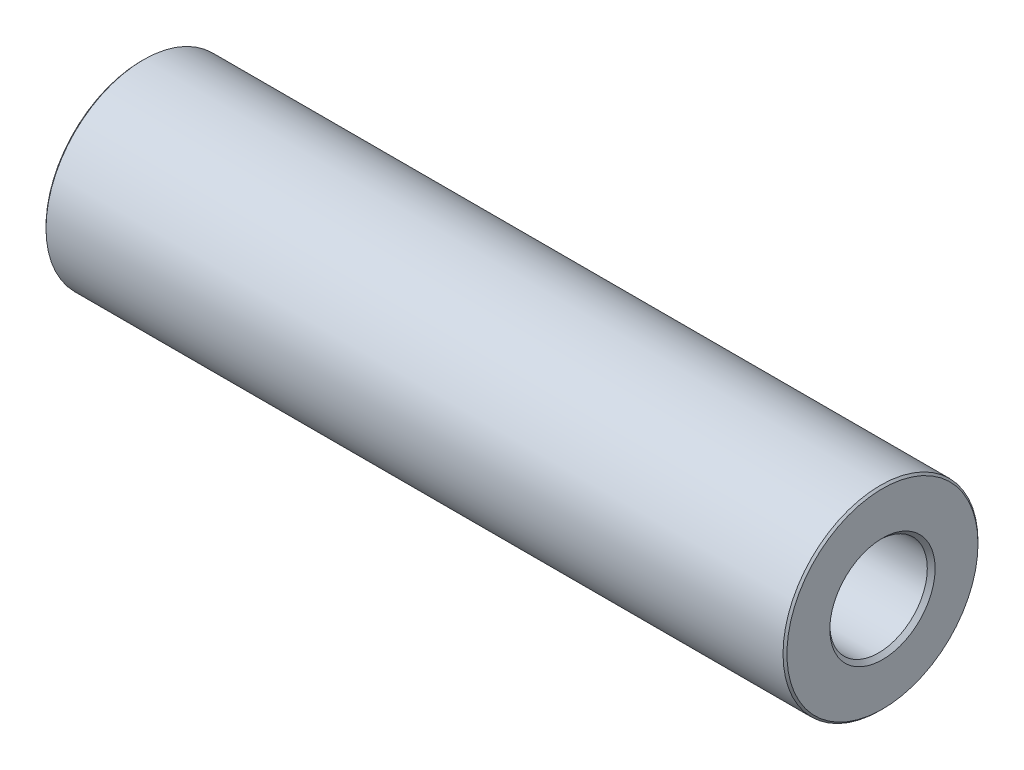
ISO-10303-21;
HEADER;
FILE_DESCRIPTION(('STEP AP214'),'2;1');
FILE_NAME('part.step','',(''),(''),'','','');
FILE_SCHEMA(('AUTOMOTIVE_DESIGN { 1 0 10303 214 1 1 1 1 }'));
ENDSEC;
DATA;
#1=APPLICATION_CONTEXT('core data for automotive mechanical design processes');
#2=APPLICATION_PROTOCOL_DEFINITION('international standard','automotive_design',2000,#1);
#3=PRODUCT_CONTEXT('',#1,'mechanical');
#4=PRODUCT('Part','Part','',(#3));
#5=PRODUCT_RELATED_PRODUCT_CATEGORY('part','',(#4));
#6=PRODUCT_DEFINITION_FORMATION('','',#4);
#7=PRODUCT_DEFINITION_CONTEXT('part definition',#1,'design');
#8=PRODUCT_DEFINITION('design','',#6,#7);
#9=PRODUCT_DEFINITION_SHAPE('','',#8);
#10=(LENGTH_UNIT() NAMED_UNIT(*) SI_UNIT(.MILLI.,.METRE.));
#11=(NAMED_UNIT(*) PLANE_ANGLE_UNIT() SI_UNIT($,.RADIAN.));
#12=(NAMED_UNIT(*) SI_UNIT($,.STERADIAN.) SOLID_ANGLE_UNIT());
#13=UNCERTAINTY_MEASURE_WITH_UNIT(LENGTH_MEASURE(1.E-05),#10,'distance_accuracy_value','');
#14=(GEOMETRIC_REPRESENTATION_CONTEXT(3) GLOBAL_UNCERTAINTY_ASSIGNED_CONTEXT((#13)) GLOBAL_UNIT_ASSIGNED_CONTEXT((#10,
#11,#12)) REPRESENTATION_CONTEXT('',''));
#15=CARTESIAN_POINT('',(0.,0.,0.));
#16=DIRECTION('',(0.,0.,1.));
#17=DIRECTION('',(1.,0.,0.));
#18=AXIS2_PLACEMENT_3D('',#15,#16,#17);
#19=CARTESIAN_POINT('',(38.,0.,0.));
#20=DIRECTION('',(1.,0.,0.));
#21=DIRECTION('',(0.,0.,-1.));
#22=AXIS2_PLACEMENT_3D('',#19,#20,#21);
#23=PLANE('',#22);
#24=CARTESIAN_POINT('',(38.,0.,0.));
#25=DIRECTION('',(1.,0.,0.));
#26=DIRECTION('',(0.,0.,-1.));
#27=AXIS2_PLACEMENT_3D('',#24,#25,#26);
#28=CIRCLE('',#27,2.69999999999999);
#29=CARTESIAN_POINT('',(38.,0.,-2.69999999999999));
#30=VERTEX_POINT('',#29);
#31=EDGE_CURVE('E8',#30,#30,#28,.F.);
#32=ORIENTED_EDGE('',*,*,#31,.T.);
#33=EDGE_LOOP('',(#32));
#34=FACE_BOUND('',#33,.T.);
#35=CARTESIAN_POINT('',(38.,0.,0.));
#36=DIRECTION('',(1.,0.,0.));
#37=DIRECTION('',(0.,0.,-1.));
#38=AXIS2_PLACEMENT_3D('',#35,#36,#37);
#39=CIRCLE('',#38,4.9);
#40=CARTESIAN_POINT('',(38.,0.,-4.9));
#41=VERTEX_POINT('',#40);
#42=EDGE_CURVE('E24',#41,#41,#39,.T.);
#43=ORIENTED_EDGE('',*,*,#42,.T.);
#44=EDGE_LOOP('',(#43));
#45=FACE_BOUND('',#44,.T.);
#46=ADVANCED_FACE('F13',(#34,#45),#23,.T.);
#47=CARTESIAN_POINT('',(0.,0.,0.));
#48=DIRECTION('',(1.,0.,0.));
#49=DIRECTION('',(0.,0.,-1.));
#50=AXIS2_PLACEMENT_3D('',#47,#48,#49);
#51=PLANE('',#50);
#52=CARTESIAN_POINT('',(0.,0.,0.));
#53=DIRECTION('',(1.,0.,0.));
#54=DIRECTION('',(0.,0.,-1.));
#55=AXIS2_PLACEMENT_3D('',#52,#53,#54);
#56=CIRCLE('',#55,2.59999999999999);
#57=CARTESIAN_POINT('',(0.,0.,-2.59999999999999));
#58=VERTEX_POINT('',#57);
#59=EDGE_CURVE('E39',#58,#58,#56,.T.);
#60=ORIENTED_EDGE('',*,*,#59,.T.);
#61=EDGE_LOOP('',(#60));
#62=FACE_BOUND('',#61,.T.);
#63=CARTESIAN_POINT('',(0.,0.,0.));
#64=DIRECTION('',(1.,0.,0.));
#65=DIRECTION('',(0.,0.,-1.));
#66=AXIS2_PLACEMENT_3D('',#63,#64,#65);
#67=CIRCLE('',#66,4.9);
#68=CARTESIAN_POINT('',(0.,0.,-4.9));
#69=VERTEX_POINT('',#68);
#70=EDGE_CURVE('E42',#69,#69,#67,.F.);
#71=ORIENTED_EDGE('',*,*,#70,.T.);
#72=EDGE_LOOP('',(#71));
#73=FACE_BOUND('',#72,.T.);
#74=ADVANCED_FACE('F46',(#62,#73),#51,.F.);
#75=CARTESIAN_POINT('',(38.,0.,0.));
#76=DIRECTION('',(-1.,0.,0.));
#77=DIRECTION('',(0.,0.,1.));
#78=AXIS2_PLACEMENT_3D('',#75,#76,#77);
#79=CYLINDRICAL_SURFACE('',#78,5.);
#80=CARTESIAN_POINT('',(0.0999999999999959,0.,0.));
#81=DIRECTION('',(1.,0.,0.));
#82=DIRECTION('',(0.,0.,-1.));
#83=AXIS2_PLACEMENT_3D('',#80,#81,#82);
#84=CIRCLE('',#83,5.);
#85=CARTESIAN_POINT('',(0.0999999999999959,0.,-5.));
#86=VERTEX_POINT('',#85);
#87=EDGE_CURVE('E28',#86,#86,#84,.T.);
#88=ORIENTED_EDGE('',*,*,#87,.T.);
#89=EDGE_LOOP('',(#88));
#90=FACE_BOUND('',#89,.T.);
#91=CARTESIAN_POINT('',(37.9,0.,0.));
#92=DIRECTION('',(1.,0.,0.));
#93=DIRECTION('',(0.,0.,-1.));
#94=AXIS2_PLACEMENT_3D('',#91,#92,#93);
#95=CIRCLE('',#94,5.);
#96=CARTESIAN_POINT('',(37.9,0.,-5.));
#97=VERTEX_POINT('',#96);
#98=EDGE_CURVE('E33',#97,#97,#95,.F.);
#99=ORIENTED_EDGE('',*,*,#98,.T.);
#100=EDGE_LOOP('',(#99));
#101=FACE_BOUND('',#100,.T.);
#102=ADVANCED_FACE('F56',(#90,#101),#79,.T.);
#103=CARTESIAN_POINT('',(38.,0.,0.));
#104=DIRECTION('',(-1.,0.,0.));
#105=DIRECTION('',(0.,0.,1.));
#106=AXIS2_PLACEMENT_3D('',#103,#104,#105);
#107=CYLINDRICAL_SURFACE('',#106,2.5);
#108=CARTESIAN_POINT('',(37.8,0.,0.));
#109=DIRECTION('',(1.,0.,0.));
#110=DIRECTION('',(0.,0.,-1.));
#111=AXIS2_PLACEMENT_3D('',#108,#109,#110);
#112=CIRCLE('',#111,2.5);
#113=CARTESIAN_POINT('',(37.8,0.,-2.5));
#114=VERTEX_POINT('',#113);
#115=EDGE_CURVE('E20',#114,#114,#112,.T.);
#116=ORIENTED_EDGE('',*,*,#115,.T.);
#117=EDGE_LOOP('',(#116));
#118=FACE_BOUND('',#117,.T.);
#119=CARTESIAN_POINT('',(0.0999999999999959,0.,0.));
#120=DIRECTION('',(1.,0.,0.));
#121=DIRECTION('',(0.,0.,-1.));
#122=AXIS2_PLACEMENT_3D('',#119,#120,#121);
#123=CIRCLE('',#122,2.5);
#124=CARTESIAN_POINT('',(0.0999999999999959,0.,-2.5));
#125=VERTEX_POINT('',#124);
#126=EDGE_CURVE('E36',#125,#125,#123,.F.);
#127=ORIENTED_EDGE('',*,*,#126,.T.);
#128=EDGE_LOOP('',(#127));
#129=FACE_BOUND('',#128,.T.);
#130=ADVANCED_FACE('F59',(#118,#129),#107,.F.);
#131=CARTESIAN_POINT('',(0.,0.,0.));
#132=DIRECTION('',(-1.,0.,0.));
#133=DIRECTION('',(0.,0.,1.));
#134=AXIS2_PLACEMENT_3D('',#131,#132,#133);
#135=CONICAL_SURFACE('',#134,2.59999999999999,0.785398163397442);
#136=ORIENTED_EDGE('',*,*,#126,.F.);
#137=EDGE_LOOP('',(#136));
#138=FACE_BOUND('',#137,.T.);
#139=ORIENTED_EDGE('',*,*,#59,.F.);
#140=EDGE_LOOP('',(#139));
#141=FACE_BOUND('',#140,.T.);
#142=ADVANCED_FACE('F52',(#138,#141),#135,.F.);
#143=CARTESIAN_POINT('',(0.0999999999999959,0.,0.));
#144=DIRECTION('',(1.,0.,0.));
#145=DIRECTION('',(0.,0.,-1.));
#146=AXIS2_PLACEMENT_3D('',#143,#144,#145);
#147=CONICAL_SURFACE('',#146,5.,0.785398163397474);
#148=ORIENTED_EDGE('',*,*,#70,.F.);
#149=EDGE_LOOP('',(#148));
#150=FACE_BOUND('',#149,.T.);
#151=ORIENTED_EDGE('',*,*,#87,.F.);
#152=EDGE_LOOP('',(#151));
#153=FACE_BOUND('',#152,.T.);
#154=ADVANCED_FACE('F48',(#150,#153),#147,.T.);
#155=CARTESIAN_POINT('',(38.,0.,0.));
#156=DIRECTION('',(-1.,0.,0.));
#157=DIRECTION('',(0.,0.,1.));
#158=AXIS2_PLACEMENT_3D('',#155,#156,#157);
#159=CONICAL_SURFACE('',#158,4.9,0.785398163397457);
#160=ORIENTED_EDGE('',*,*,#98,.F.);
#161=EDGE_LOOP('',(#160));
#162=FACE_BOUND('',#161,.T.);
#163=ORIENTED_EDGE('',*,*,#42,.F.);
#164=EDGE_LOOP('',(#163));
#165=FACE_BOUND('',#164,.T.);
#166=ADVANCED_FACE('F51',(#162,#165),#159,.T.);
#167=CARTESIAN_POINT('',(37.8,0.,0.));
#168=DIRECTION('',(1.,0.,0.));
#169=DIRECTION('',(0.,0.,-1.));
#170=AXIS2_PLACEMENT_3D('',#167,#168,#169);
#171=CONICAL_SURFACE('',#170,2.5,0.785398163397428);
#172=ORIENTED_EDGE('',*,*,#31,.F.);
#173=EDGE_LOOP('',(#172));
#174=FACE_BOUND('',#173,.T.);
#175=ORIENTED_EDGE('',*,*,#115,.F.);
#176=EDGE_LOOP('',(#175));
#177=FACE_BOUND('',#176,.T.);
#178=ADVANCED_FACE('F15',(#174,#177),#171,.F.);
#179=CLOSED_SHELL('',(#46,#74,#102,#130,#142,#154,#166,#178));
#180=MANIFOLD_SOLID_BREP('B1',#179);
#181=ADVANCED_BREP_SHAPE_REPRESENTATION('',(#18,#180),#14);
#182=SHAPE_DEFINITION_REPRESENTATION(#9,#181);
ENDSEC;
END-ISO-10303-21;
